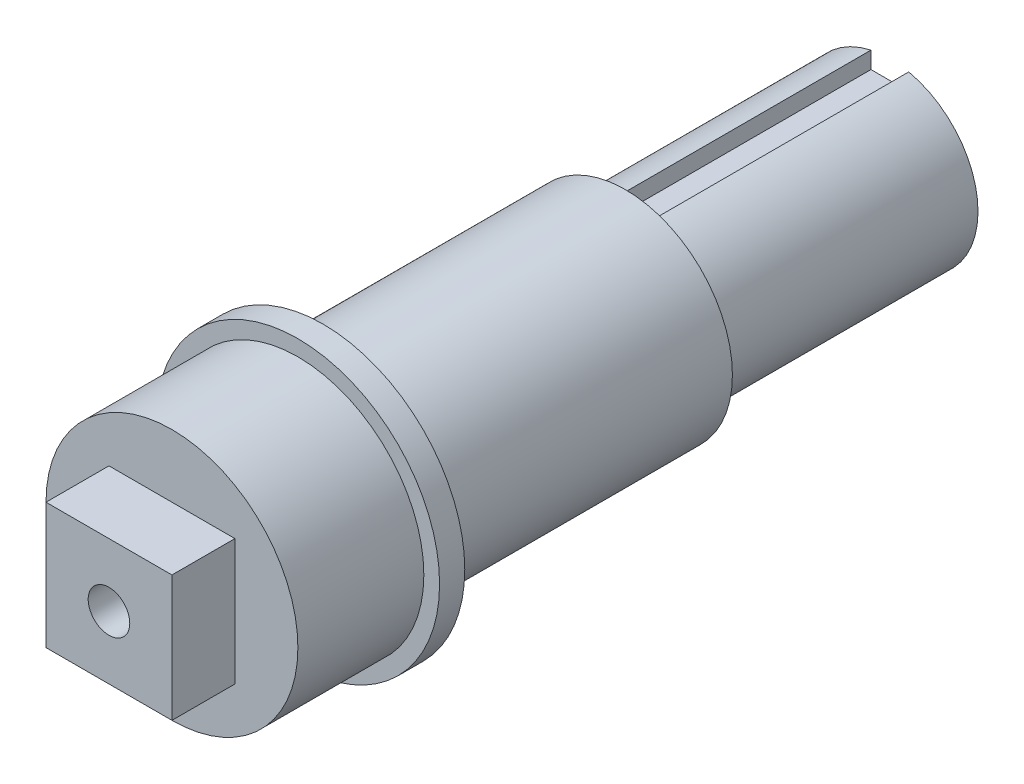
ISO-10303-21;
HEADER;
FILE_DESCRIPTION(('STEP AP214'),'2;1');
FILE_NAME('part.step','',(''),(''),'','','');
FILE_SCHEMA(('AUTOMOTIVE_DESIGN { 1 0 10303 214 1 1 1 1 }'));
ENDSEC;
DATA;
#1=APPLICATION_CONTEXT('core data for automotive mechanical design processes');
#2=APPLICATION_PROTOCOL_DEFINITION('international standard','automotive_design',2000,#1);
#3=PRODUCT_CONTEXT('',#1,'mechanical');
#4=PRODUCT('Part','Part','',(#3));
#5=PRODUCT_RELATED_PRODUCT_CATEGORY('part','',(#4));
#6=PRODUCT_DEFINITION_FORMATION('','',#4);
#7=PRODUCT_DEFINITION_CONTEXT('part definition',#1,'design');
#8=PRODUCT_DEFINITION('design','',#6,#7);
#9=PRODUCT_DEFINITION_SHAPE('','',#8);
#10=(LENGTH_UNIT() NAMED_UNIT(*) SI_UNIT(.MILLI.,.METRE.));
#11=(NAMED_UNIT(*) PLANE_ANGLE_UNIT() SI_UNIT($,.RADIAN.));
#12=(NAMED_UNIT(*) SI_UNIT($,.STERADIAN.) SOLID_ANGLE_UNIT());
#13=UNCERTAINTY_MEASURE_WITH_UNIT(LENGTH_MEASURE(1.E-05),#10,'distance_accuracy_value','');
#14=(GEOMETRIC_REPRESENTATION_CONTEXT(3) GLOBAL_UNCERTAINTY_ASSIGNED_CONTEXT((#13)) GLOBAL_UNIT_ASSIGNED_CONTEXT((#10,
#11,#12)) REPRESENTATION_CONTEXT('',''));
#15=CARTESIAN_POINT('',(0.,0.,0.));
#16=DIRECTION('',(0.,0.,1.));
#17=DIRECTION('',(1.,0.,0.));
#18=AXIS2_PLACEMENT_3D('',#15,#16,#17);
#19=CARTESIAN_POINT('',(0.,0.,62.));
#20=DIRECTION('',(0.,0.,-1.));
#21=DIRECTION('',(-1.,0.,0.));
#22=AXIS2_PLACEMENT_3D('',#19,#20,#21);
#23=CYLINDRICAL_SURFACE('',#22,10.);
#24=CARTESIAN_POINT('',(0.,0.,47.));
#25=DIRECTION('',(0.,0.,-1.));
#26=DIRECTION('',(-1.,0.,0.));
#27=AXIS2_PLACEMENT_3D('',#24,#25,#26);
#28=CIRCLE('',#27,10.);
#29=CARTESIAN_POINT('',(-10.,0.,47.));
#30=VERTEX_POINT('',#29);
#31=EDGE_CURVE('E11',#30,#30,#28,.T.);
#32=ORIENTED_EDGE('',*,*,#31,.F.);
#33=EDGE_LOOP('',(#32));
#34=FACE_BOUND('',#33,.T.);
#35=CARTESIAN_POINT('',(0.,0.,57.));
#36=DIRECTION('',(0.,0.,1.));
#37=DIRECTION('',(1.,0.,0.));
#38=AXIS2_PLACEMENT_3D('',#35,#36,#37);
#39=CIRCLE('',#38,10.);
#40=CARTESIAN_POINT('',(10.,0.,57.));
#41=VERTEX_POINT('',#40);
#42=EDGE_CURVE('E43',#41,#41,#39,.T.);
#43=ORIENTED_EDGE('',*,*,#42,.F.);
#44=EDGE_LOOP('',(#43));
#45=FACE_BOUND('',#44,.T.);
#46=ADVANCED_FACE('F39',(#34,#45),#23,.T.);
#47=CARTESIAN_POINT('',(0.,0.,21.));
#48=DIRECTION('',(0.,0.,-1.));
#49=DIRECTION('',(-1.,0.,0.));
#50=AXIS2_PLACEMENT_3D('',#47,#48,#49);
#51=CYLINDRICAL_SURFACE('',#50,7.);
#52=CARTESIAN_POINT('',(0.,0.,21.));
#53=DIRECTION('',(0.,0.,1.));
#54=DIRECTION('',(1.,0.,0.));
#55=AXIS2_PLACEMENT_3D('',#52,#53,#54);
#56=CIRCLE('',#55,7.);
#57=CARTESIAN_POINT('',(-1.5,6.83739716558867,21.));
#58=VERTEX_POINT('',#57);
#59=CARTESIAN_POINT('',(1.5,6.83739716558867,21.));
#60=VERTEX_POINT('',#59);
#61=EDGE_CURVE('E211',#58,#60,#56,.T.);
#62=ORIENTED_EDGE('',*,*,#61,.F.);
#63=DIRECTION('',(0.,0.,-1.));
#64=VECTOR('',#63,1.);
#65=CARTESIAN_POINT('',(-1.5,6.83739716558867,21.));
#66=LINE('',#65,#64);
#67=CARTESIAN_POINT('',(-1.5,6.83739716558867,0.));
#68=VERTEX_POINT('',#67);
#69=EDGE_CURVE('E206',#58,#68,#66,.T.);
#70=ORIENTED_EDGE('',*,*,#69,.T.);
#71=CARTESIAN_POINT('',(0.,0.,0.));
#72=DIRECTION('',(0.,0.,1.));
#73=DIRECTION('',(1.,0.,0.));
#74=AXIS2_PLACEMENT_3D('',#71,#72,#73);
#75=CIRCLE('',#74,7.);
#76=CARTESIAN_POINT('',(1.5,6.83739716558867,0.));
#77=VERTEX_POINT('',#76);
#78=EDGE_CURVE('E210',#68,#77,#75,.T.);
#79=ORIENTED_EDGE('',*,*,#78,.T.);
#80=DIRECTION('',(0.,0.,-1.));
#81=VECTOR('',#80,1.);
#82=CARTESIAN_POINT('',(1.5,6.83739716558867,21.));
#83=LINE('',#82,#81);
#84=EDGE_CURVE('E64',#77,#60,#83,.F.);
#85=ORIENTED_EDGE('',*,*,#84,.T.);
#86=EDGE_LOOP('',(#62,#70,#79,#85));
#87=FACE_BOUND('',#86,.T.);
#88=ADVANCED_FACE('F255',(#87),#51,.T.);
#89=CARTESIAN_POINT('',(0.,0.,0.));
#90=DIRECTION('',(0.,0.,1.));
#91=DIRECTION('',(1.,0.,0.));
#92=AXIS2_PLACEMENT_3D('',#89,#90,#91);
#93=PLANE('',#92);
#94=ORIENTED_EDGE('',*,*,#78,.F.);
#95=DIRECTION('',(0.,1.,0.));
#96=VECTOR('',#95,1.);
#97=CARTESIAN_POINT('',(-1.5,5.5,0.));
#98=LINE('',#97,#96);
#99=CARTESIAN_POINT('',(-1.5,5.5,0.));
#100=VERTEX_POINT('',#99);
#101=EDGE_CURVE('E178',#100,#68,#98,.T.);
#102=ORIENTED_EDGE('',*,*,#101,.F.);
#103=DIRECTION('',(-1.,0.,0.));
#104=VECTOR('',#103,1.);
#105=CARTESIAN_POINT('',(1.5,5.5,0.));
#106=LINE('',#105,#104);
#107=CARTESIAN_POINT('',(1.5,5.5,0.));
#108=VERTEX_POINT('',#107);
#109=EDGE_CURVE('E184',#108,#100,#106,.T.);
#110=ORIENTED_EDGE('',*,*,#109,.F.);
#111=DIRECTION('',(0.,1.,0.));
#112=VECTOR('',#111,1.);
#113=CARTESIAN_POINT('',(1.5,0.,0.));
#114=LINE('',#113,#112);
#115=EDGE_CURVE('E215',#108,#77,#114,.T.);
#116=ORIENTED_EDGE('',*,*,#115,.T.);
#117=EDGE_LOOP('',(#94,#102,#110,#116));
#118=FACE_BOUND('',#117,.T.);
#119=ADVANCED_FACE('F261',(#118),#93,.F.);
#120=CARTESIAN_POINT('',(-1.5,5.5,21.));
#121=DIRECTION('',(-1.,0.,0.));
#122=DIRECTION('',(0.,0.,1.));
#123=AXIS2_PLACEMENT_3D('',#120,#121,#122);
#124=PLANE('',#123);
#125=DIRECTION('',(0.,1.,0.));
#126=VECTOR('',#125,1.);
#127=CARTESIAN_POINT('',(-1.5,5.5,21.));
#128=LINE('',#127,#126);
#129=CARTESIAN_POINT('',(-1.5,5.5,21.));
#130=VERTEX_POINT('',#129);
#131=EDGE_CURVE('E179',#130,#58,#128,.T.);
#132=ORIENTED_EDGE('',*,*,#131,.F.);
#133=DIRECTION('',(0.,0.,-1.));
#134=VECTOR('',#133,1.);
#135=CARTESIAN_POINT('',(-1.5,5.5,21.));
#136=LINE('',#135,#134);
#137=EDGE_CURVE('E198',#130,#100,#136,.T.);
#138=ORIENTED_EDGE('',*,*,#137,.T.);
#139=ORIENTED_EDGE('',*,*,#101,.T.);
#140=ORIENTED_EDGE('',*,*,#69,.F.);
#141=EDGE_LOOP('',(#132,#138,#139,#140));
#142=FACE_BOUND('',#141,.T.);
#143=ADVANCED_FACE('F279',(#142),#124,.F.);
#144=CARTESIAN_POINT('',(1.5,5.5,21.));
#145=DIRECTION('',(1.,0.,0.));
#146=DIRECTION('',(0.,0.,-1.));
#147=AXIS2_PLACEMENT_3D('',#144,#145,#146);
#148=PLANE('',#147);
#149=ORIENTED_EDGE('',*,*,#115,.F.);
#150=DIRECTION('',(0.,0.,-1.));
#151=VECTOR('',#150,1.);
#152=CARTESIAN_POINT('',(1.5,5.5,21.));
#153=LINE('',#152,#151);
#154=CARTESIAN_POINT('',(1.5,5.5,21.));
#155=VERTEX_POINT('',#154);
#156=EDGE_CURVE('E192',#155,#108,#153,.T.);
#157=ORIENTED_EDGE('',*,*,#156,.F.);
#158=DIRECTION('',(0.,-1.,0.));
#159=VECTOR('',#158,1.);
#160=CARTESIAN_POINT('',(1.5,5.5,21.));
#161=LINE('',#160,#159);
#162=EDGE_CURVE('E183',#60,#155,#161,.T.);
#163=ORIENTED_EDGE('',*,*,#162,.F.);
#164=ORIENTED_EDGE('',*,*,#84,.F.);
#165=EDGE_LOOP('',(#149,#157,#163,#164));
#166=FACE_BOUND('',#165,.T.);
#167=ADVANCED_FACE('F275',(#166),#148,.F.);
#168=CARTESIAN_POINT('',(1.5,5.5,21.));
#169=DIRECTION('',(0.,-1.,0.));
#170=DIRECTION('',(0.,0.,-1.));
#171=AXIS2_PLACEMENT_3D('',#168,#169,#170);
#172=PLANE('',#171);
#173=ORIENTED_EDGE('',*,*,#109,.T.);
#174=ORIENTED_EDGE('',*,*,#137,.F.);
#175=DIRECTION('',(-1.,0.,0.));
#176=VECTOR('',#175,1.);
#177=CARTESIAN_POINT('',(1.5,5.5,21.));
#178=LINE('',#177,#176);
#179=EDGE_CURVE('E188',#155,#130,#178,.T.);
#180=ORIENTED_EDGE('',*,*,#179,.F.);
#181=ORIENTED_EDGE('',*,*,#156,.T.);
#182=EDGE_LOOP('',(#173,#174,#180,#181));
#183=FACE_BOUND('',#182,.T.);
#184=ADVANCED_FACE('F269',(#183),#172,.F.);
#185=CARTESIAN_POINT('',(0.,0.,21.));
#186=DIRECTION('',(0.,0.,1.));
#187=DIRECTION('',(1.,0.,0.));
#188=AXIS2_PLACEMENT_3D('',#185,#186,#187);
#189=PLANE('',#188);
#190=CARTESIAN_POINT('',(0.,0.,21.));
#191=DIRECTION('',(0.,0.,1.));
#192=DIRECTION('',(1.,0.,0.));
#193=AXIS2_PLACEMENT_3D('',#190,#191,#192);
#194=CIRCLE('',#193,8.5);
#195=CARTESIAN_POINT('',(8.5,0.,21.));
#196=VERTEX_POINT('',#195);
#197=EDGE_CURVE('E170',#196,#196,#194,.T.);
#198=ORIENTED_EDGE('',*,*,#197,.F.);
#199=EDGE_LOOP('',(#198));
#200=FACE_BOUND('',#199,.T.);
#201=ORIENTED_EDGE('',*,*,#179,.T.);
#202=ORIENTED_EDGE('',*,*,#131,.T.);
#203=ORIENTED_EDGE('',*,*,#61,.T.);
#204=ORIENTED_EDGE('',*,*,#162,.T.);
#205=EDGE_LOOP('',(#201,#202,#203,#204));
#206=FACE_BOUND('',#205,.T.);
#207=ADVANCED_FACE('F266',(#200,#206),#189,.F.);
#208=CARTESIAN_POINT('',(0.,0.,45.));
#209=DIRECTION('',(0.,0.,-1.));
#210=DIRECTION('',(-1.,0.,0.));
#211=AXIS2_PLACEMENT_3D('',#208,#209,#210);
#212=CYLINDRICAL_SURFACE('',#211,8.5);
#213=CARTESIAN_POINT('',(0.,0.,44.4));
#214=DIRECTION('',(0.,0.,1.));
#215=DIRECTION('',(1.,0.,0.));
#216=AXIS2_PLACEMENT_3D('',#213,#214,#215);
#217=CIRCLE('',#216,8.5);
#218=CARTESIAN_POINT('',(8.5,0.,44.4));
#219=VERTEX_POINT('',#218);
#220=EDGE_CURVE('E49',#219,#219,#217,.F.);
#221=ORIENTED_EDGE('',*,*,#220,.T.);
#222=EDGE_LOOP('',(#221));
#223=FACE_BOUND('',#222,.T.);
#224=ORIENTED_EDGE('',*,*,#197,.T.);
#225=EDGE_LOOP('',(#224));
#226=FACE_BOUND('',#225,.T.);
#227=ADVANCED_FACE('F229',(#223,#226),#212,.T.);
#228=CARTESIAN_POINT('',(0.,0.,45.));
#229=DIRECTION('',(0.,0.,1.));
#230=DIRECTION('',(1.,0.,0.));
#231=AXIS2_PLACEMENT_3D('',#228,#229,#230);
#232=PLANE('',#231);
#233=CARTESIAN_POINT('',(0.,0.,45.));
#234=DIRECTION('',(0.,0.,1.));
#235=DIRECTION('',(1.,0.,0.));
#236=AXIS2_PLACEMENT_3D('',#233,#234,#235);
#237=CIRCLE('',#236,9.1);
#238=CARTESIAN_POINT('',(9.1,0.,45.));
#239=VERTEX_POINT('',#238);
#240=EDGE_CURVE('E221',#239,#239,#237,.T.);
#241=ORIENTED_EDGE('',*,*,#240,.T.);
#242=EDGE_LOOP('',(#241));
#243=FACE_BOUND('',#242,.T.);
#244=CARTESIAN_POINT('',(0.,0.,45.));
#245=DIRECTION('',(0.,0.,-1.));
#246=DIRECTION('',(-1.,0.,0.));
#247=AXIS2_PLACEMENT_3D('',#244,#245,#246);
#248=CIRCLE('',#247,11.25);
#249=CARTESIAN_POINT('',(-11.25,0.,45.));
#250=VERTEX_POINT('',#249);
#251=EDGE_CURVE('E171',#250,#250,#248,.T.);
#252=ORIENTED_EDGE('',*,*,#251,.T.);
#253=EDGE_LOOP('',(#252));
#254=FACE_BOUND('',#253,.T.);
#255=ADVANCED_FACE('F235',(#243,#254),#232,.F.);
#256=CARTESIAN_POINT('',(0.,0.,44.4));
#257=DIRECTION('',(0.,0.,1.));
#258=DIRECTION('',(1.,0.,0.));
#259=AXIS2_PLACEMENT_3D('',#256,#257,#258);
#260=TOROIDAL_SURFACE('',#259,9.1,0.6);
#261=ORIENTED_EDGE('',*,*,#220,.F.);
#262=EDGE_LOOP('',(#261));
#263=FACE_BOUND('',#262,.T.);
#264=ORIENTED_EDGE('',*,*,#240,.F.);
#265=EDGE_LOOP('',(#264));
#266=FACE_BOUND('',#265,.T.);
#267=ADVANCED_FACE('F41',(#263,#266),#260,.F.);
#268=CARTESIAN_POINT('',(0.,0.,47.));
#269=DIRECTION('',(0.,0.,-1.));
#270=DIRECTION('',(-1.,0.,0.));
#271=AXIS2_PLACEMENT_3D('',#268,#269,#270);
#272=CYLINDRICAL_SURFACE('',#271,11.25);
#273=CARTESIAN_POINT('',(0.,0.,47.));
#274=DIRECTION('',(0.,0.,-1.));
#275=DIRECTION('',(-1.,0.,0.));
#276=AXIS2_PLACEMENT_3D('',#273,#274,#275);
#277=CIRCLE('',#276,11.25);
#278=CARTESIAN_POINT('',(-11.25,0.,47.));
#279=VERTEX_POINT('',#278);
#280=EDGE_CURVE('E166',#279,#279,#277,.T.);
#281=ORIENTED_EDGE('',*,*,#280,.T.);
#282=EDGE_LOOP('',(#281));
#283=FACE_BOUND('',#282,.T.);
#284=ORIENTED_EDGE('',*,*,#251,.F.);
#285=EDGE_LOOP('',(#284));
#286=FACE_BOUND('',#285,.T.);
#287=ADVANCED_FACE('F234',(#283,#286),#272,.T.);
#288=CARTESIAN_POINT('',(0.,0.,47.));
#289=DIRECTION('',(0.,0.,-1.));
#290=DIRECTION('',(-1.,0.,0.));
#291=AXIS2_PLACEMENT_3D('',#288,#289,#290);
#292=PLANE('',#291);
#293=ORIENTED_EDGE('',*,*,#31,.T.);
#294=EDGE_LOOP('',(#293));
#295=FACE_BOUND('',#294,.T.);
#296=ORIENTED_EDGE('',*,*,#280,.F.);
#297=EDGE_LOOP('',(#296));
#298=FACE_BOUND('',#297,.T.);
#299=ADVANCED_FACE('F244',(#295,#298),#292,.F.);
#300=CARTESIAN_POINT('',(0.,0.,57.));
#301=DIRECTION('',(0.,0.,1.));
#302=DIRECTION('',(1.,0.,0.));
#303=AXIS2_PLACEMENT_3D('',#300,#301,#302);
#304=PLANE('',#303);
#305=DIRECTION('',(0.,1.,0.));
#306=VECTOR('',#305,1.);
#307=CARTESIAN_POINT('',(5.,0.,57.));
#308=LINE('',#307,#306);
#309=CARTESIAN_POINT('',(5.,-5.,57.));
#310=VERTEX_POINT('',#309);
#311=CARTESIAN_POINT('',(5.,5.,57.));
#312=VERTEX_POINT('',#311);
#313=EDGE_CURVE('E133',#310,#312,#308,.T.);
#314=ORIENTED_EDGE('',*,*,#313,.F.);
#315=DIRECTION('',(1.,0.,0.));
#316=VECTOR('',#315,1.);
#317=CARTESIAN_POINT('',(0.,-5.,57.));
#318=LINE('',#317,#316);
#319=CARTESIAN_POINT('',(-5.,-5.,57.));
#320=VERTEX_POINT('',#319);
#321=EDGE_CURVE('E140',#320,#310,#318,.T.);
#322=ORIENTED_EDGE('',*,*,#321,.F.);
#323=DIRECTION('',(0.,1.,0.));
#324=VECTOR('',#323,1.);
#325=CARTESIAN_POINT('',(-5.,0.,57.));
#326=LINE('',#325,#324);
#327=CARTESIAN_POINT('',(-5.,5.,57.));
#328=VERTEX_POINT('',#327);
#329=EDGE_CURVE('E135',#320,#328,#326,.T.);
#330=ORIENTED_EDGE('',*,*,#329,.T.);
#331=DIRECTION('',(1.,0.,0.));
#332=VECTOR('',#331,1.);
#333=CARTESIAN_POINT('',(0.,5.,57.));
#334=LINE('',#333,#332);
#335=EDGE_CURVE('E129',#328,#312,#334,.T.);
#336=ORIENTED_EDGE('',*,*,#335,.T.);
#337=EDGE_LOOP('',(#314,#322,#330,#336));
#338=FACE_BOUND('',#337,.T.);
#339=ORIENTED_EDGE('',*,*,#42,.T.);
#340=EDGE_LOOP('',(#339));
#341=FACE_BOUND('',#340,.T.);
#342=ADVANCED_FACE('F250',(#338,#341),#304,.T.);
#343=CARTESIAN_POINT('',(5.,0.,93.1126983722081));
#344=DIRECTION('',(-1.,0.,0.));
#345=DIRECTION('',(0.,0.,1.));
#346=AXIS2_PLACEMENT_3D('',#343,#344,#345);
#347=PLANE('',#346);
#348=DIRECTION('',(0.,0.,-1.));
#349=VECTOR('',#348,1.);
#350=CARTESIAN_POINT('',(5.,-5.,93.1126983722081));
#351=LINE('',#350,#349);
#352=CARTESIAN_POINT('',(5.,-5.,62.));
#353=VERTEX_POINT('',#352);
#354=EDGE_CURVE('E153',#353,#310,#351,.T.);
#355=ORIENTED_EDGE('',*,*,#354,.T.);
#356=ORIENTED_EDGE('',*,*,#313,.T.);
#357=DIRECTION('',(0.,0.,-1.));
#358=VECTOR('',#357,1.);
#359=CARTESIAN_POINT('',(5.,5.,93.1126983722081));
#360=LINE('',#359,#358);
#361=CARTESIAN_POINT('',(5.,5.,62.));
#362=VERTEX_POINT('',#361);
#363=EDGE_CURVE('E124',#362,#312,#360,.T.);
#364=ORIENTED_EDGE('',*,*,#363,.F.);
#365=DIRECTION('',(0.,1.,0.));
#366=VECTOR('',#365,1.);
#367=CARTESIAN_POINT('',(5.,0.,62.));
#368=LINE('',#367,#366);
#369=EDGE_CURVE('E118',#353,#362,#368,.T.);
#370=ORIENTED_EDGE('',*,*,#369,.F.);
#371=EDGE_LOOP('',(#355,#356,#364,#370));
#372=FACE_BOUND('',#371,.T.);
#373=ADVANCED_FACE('F353',(#372),#347,.F.);
#374=CARTESIAN_POINT('',(0.,-5.,93.1126983722081));
#375=DIRECTION('',(0.,1.,0.));
#376=DIRECTION('',(0.,0.,1.));
#377=AXIS2_PLACEMENT_3D('',#374,#375,#376);
#378=PLANE('',#377);
#379=DIRECTION('',(0.,0.,-1.));
#380=VECTOR('',#379,1.);
#381=CARTESIAN_POINT('',(-5.,-5.,93.1126983722081));
#382=LINE('',#381,#380);
#383=CARTESIAN_POINT('',(-5.,-5.,62.));
#384=VERTEX_POINT('',#383);
#385=EDGE_CURVE('E139',#384,#320,#382,.T.);
#386=ORIENTED_EDGE('',*,*,#385,.T.);
#387=ORIENTED_EDGE('',*,*,#321,.T.);
#388=ORIENTED_EDGE('',*,*,#354,.F.);
#389=DIRECTION('',(1.,0.,0.));
#390=VECTOR('',#389,1.);
#391=CARTESIAN_POINT('',(0.,-5.,62.));
#392=LINE('',#391,#390);
#393=EDGE_CURVE('E150',#384,#353,#392,.T.);
#394=ORIENTED_EDGE('',*,*,#393,.F.);
#395=EDGE_LOOP('',(#386,#387,#388,#394));
#396=FACE_BOUND('',#395,.T.);
#397=ADVANCED_FACE('F371',(#396),#378,.F.);
#398=CARTESIAN_POINT('',(-5.,0.,93.1126983722081));
#399=DIRECTION('',(-1.,0.,0.));
#400=DIRECTION('',(0.,0.,1.));
#401=AXIS2_PLACEMENT_3D('',#398,#399,#400);
#402=PLANE('',#401);
#403=DIRECTION('',(0.,1.,0.));
#404=VECTOR('',#403,1.);
#405=CARTESIAN_POINT('',(-5.,0.,62.));
#406=LINE('',#405,#404);
#407=CARTESIAN_POINT('',(-5.,5.,62.));
#408=VERTEX_POINT('',#407);
#409=EDGE_CURVE('E56',#384,#408,#406,.T.);
#410=ORIENTED_EDGE('',*,*,#409,.T.);
#411=DIRECTION('',(0.,0.,-1.));
#412=VECTOR('',#411,1.);
#413=CARTESIAN_POINT('',(-5.,5.,93.1126983722081));
#414=LINE('',#413,#412);
#415=EDGE_CURVE('E134',#408,#328,#414,.T.);
#416=ORIENTED_EDGE('',*,*,#415,.T.);
#417=ORIENTED_EDGE('',*,*,#329,.F.);
#418=ORIENTED_EDGE('',*,*,#385,.F.);
#419=EDGE_LOOP('',(#410,#416,#417,#418));
#420=FACE_BOUND('',#419,.T.);
#421=ADVANCED_FACE('F380',(#420),#402,.T.);
#422=CARTESIAN_POINT('',(0.,5.,93.1126983722081));
#423=DIRECTION('',(0.,1.,0.));
#424=DIRECTION('',(0.,0.,1.));
#425=AXIS2_PLACEMENT_3D('',#422,#423,#424);
#426=PLANE('',#425);
#427=DIRECTION('',(1.,0.,0.));
#428=VECTOR('',#427,1.);
#429=CARTESIAN_POINT('',(0.,5.,62.));
#430=LINE('',#429,#428);
#431=EDGE_CURVE('E149',#408,#362,#430,.T.);
#432=ORIENTED_EDGE('',*,*,#431,.T.);
#433=ORIENTED_EDGE('',*,*,#363,.T.);
#434=ORIENTED_EDGE('',*,*,#335,.F.);
#435=ORIENTED_EDGE('',*,*,#415,.F.);
#436=EDGE_LOOP('',(#432,#433,#434,#435));
#437=FACE_BOUND('',#436,.T.);
#438=ADVANCED_FACE('F389',(#437),#426,.T.);
#439=CARTESIAN_POINT('',(0.,0.,62.));
#440=DIRECTION('',(0.,0.,1.));
#441=DIRECTION('',(1.,0.,0.));
#442=AXIS2_PLACEMENT_3D('',#439,#440,#441);
#443=PLANE('',#442);
#444=CARTESIAN_POINT('',(0.,0.,62.));
#445=DIRECTION('',(0.,0.,1.));
#446=DIRECTION('',(1.,0.,0.));
#447=AXIS2_PLACEMENT_3D('',#444,#445,#446);
#448=CIRCLE('',#447,1.64999999999999);
#449=CARTESIAN_POINT('',(1.64999999999999,0.,62.));
#450=VERTEX_POINT('',#449);
#451=EDGE_CURVE('E119',#450,#450,#448,.T.);
#452=ORIENTED_EDGE('',*,*,#451,.F.);
#453=EDGE_LOOP('',(#452));
#454=FACE_BOUND('',#453,.T.);
#455=ORIENTED_EDGE('',*,*,#369,.T.);
#456=ORIENTED_EDGE('',*,*,#431,.F.);
#457=ORIENTED_EDGE('',*,*,#409,.F.);
#458=ORIENTED_EDGE('',*,*,#393,.T.);
#459=EDGE_LOOP('',(#455,#456,#457,#458));
#460=FACE_BOUND('',#459,.T.);
#461=ADVANCED_FACE('F111',(#454,#460),#443,.T.);
#462=CARTESIAN_POINT('',(0.,0.,42.));
#463=DIRECTION('',(0.,0.,1.));
#464=DIRECTION('',(1.,0.,0.));
#465=AXIS2_PLACEMENT_3D('',#462,#463,#464);
#466=CONICAL_SURFACE('',#465,1.65,1.02974425867665);
#467=CARTESIAN_POINT('',(0.,0.,41.0085799786045));
#468=VERTEX_POINT('',#467);
#469=VERTEX_LOOP('',#468);
#470=FACE_BOUND('',#469,.T.);
#471=CARTESIAN_POINT('',(0.,0.,42.));
#472=DIRECTION('',(0.,0.,1.));
#473=DIRECTION('',(1.,0.,0.));
#474=AXIS2_PLACEMENT_3D('',#471,#472,#473);
#475=CIRCLE('',#474,1.65);
#476=CARTESIAN_POINT('',(1.65,0.,42.));
#477=VERTEX_POINT('',#476);
#478=EDGE_CURVE('E115',#477,#477,#475,.T.);
#479=ORIENTED_EDGE('',*,*,#478,.T.);
#480=EDGE_LOOP('',(#479));
#481=FACE_BOUND('',#480,.T.);
#482=ADVANCED_FACE('F107',(#470,#481),#466,.F.);
#483=CARTESIAN_POINT('',(0.,0.,62.));
#484=DIRECTION('',(0.,0.,1.));
#485=DIRECTION('',(1.,0.,0.));
#486=AXIS2_PLACEMENT_3D('',#483,#484,#485);
#487=CYLINDRICAL_SURFACE('',#486,1.64999999999999);
#488=ORIENTED_EDGE('',*,*,#478,.F.);
#489=EDGE_LOOP('',(#488));
#490=FACE_BOUND('',#489,.T.);
#491=ORIENTED_EDGE('',*,*,#451,.T.);
#492=EDGE_LOOP('',(#491));
#493=FACE_BOUND('',#492,.T.);
#494=ADVANCED_FACE('F110',(#490,#493),#487,.F.);
#495=CLOSED_SHELL('',(#46,#88,#119,#143,#167,#184,#207,#227,#255,#267,#287,#299,#342,#373,#397,
#421,#438,#461,#482,#494));
#496=MANIFOLD_SOLID_BREP('B2',#495);
#497=ADVANCED_BREP_SHAPE_REPRESENTATION('',(#18,#496),#14);
#498=SHAPE_DEFINITION_REPRESENTATION(#9,#497);
ENDSEC;
END-ISO-10303-21;
